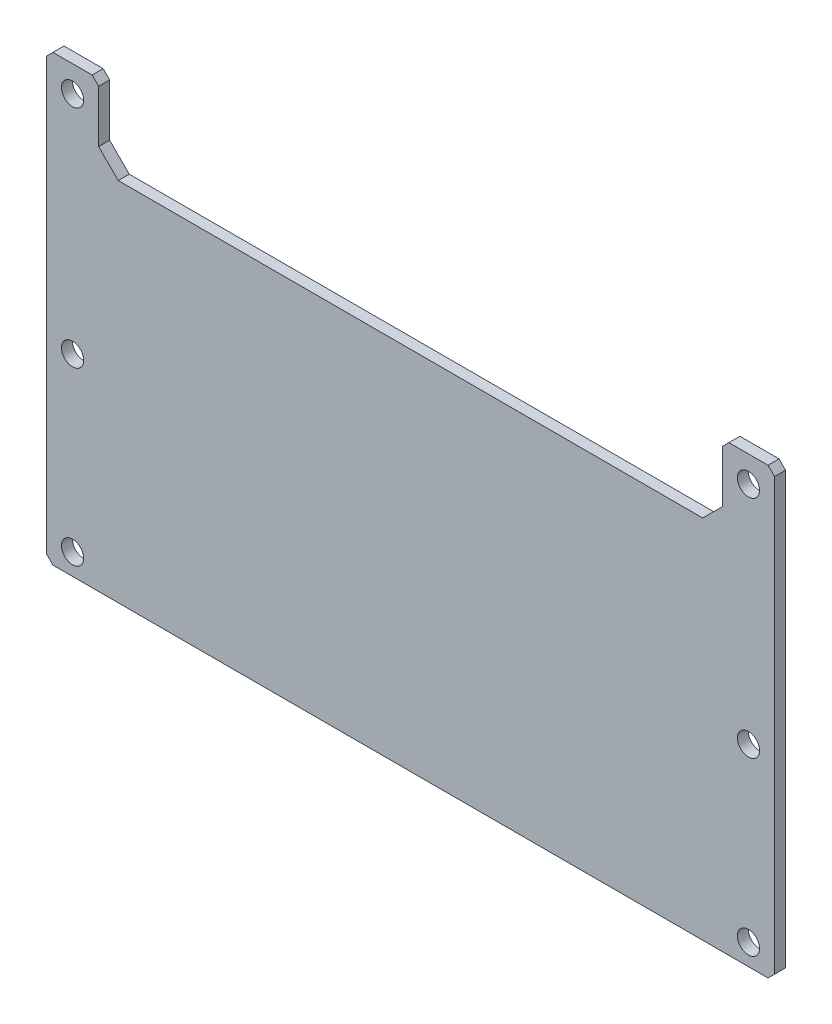
ISO-10303-21;
HEADER;
FILE_DESCRIPTION(('STEP AP214'),'2;1');
FILE_NAME('part.step','',(''),(''),'','','');
FILE_SCHEMA(('AUTOMOTIVE_DESIGN { 1 0 10303 214 1 1 1 1 }'));
ENDSEC;
DATA;
#1=APPLICATION_CONTEXT('core data for automotive mechanical design processes');
#2=APPLICATION_PROTOCOL_DEFINITION('international standard','automotive_design',2000,#1);
#3=PRODUCT_CONTEXT('',#1,'mechanical');
#4=PRODUCT('Part','Part','',(#3));
#5=PRODUCT_RELATED_PRODUCT_CATEGORY('part','',(#4));
#6=PRODUCT_DEFINITION_FORMATION('','',#4);
#7=PRODUCT_DEFINITION_CONTEXT('part definition',#1,'design');
#8=PRODUCT_DEFINITION('design','',#6,#7);
#9=PRODUCT_DEFINITION_SHAPE('','',#8);
#10=(LENGTH_UNIT() NAMED_UNIT(*) SI_UNIT(.MILLI.,.METRE.));
#11=(NAMED_UNIT(*) PLANE_ANGLE_UNIT() SI_UNIT($,.RADIAN.));
#12=(NAMED_UNIT(*) SI_UNIT($,.STERADIAN.) SOLID_ANGLE_UNIT());
#13=UNCERTAINTY_MEASURE_WITH_UNIT(LENGTH_MEASURE(1.E-05),#10,'distance_accuracy_value','');
#14=(GEOMETRIC_REPRESENTATION_CONTEXT(3) GLOBAL_UNCERTAINTY_ASSIGNED_CONTEXT((#13)) GLOBAL_UNIT_ASSIGNED_CONTEXT((#10,
#11,#12)) REPRESENTATION_CONTEXT('',''));
#15=CARTESIAN_POINT('',(0.,0.,0.));
#16=DIRECTION('',(0.,0.,1.));
#17=DIRECTION('',(1.,0.,0.));
#18=AXIS2_PLACEMENT_3D('',#15,#16,#17);
#19=CARTESIAN_POINT('',(0.,0.,1.68656));
#20=DIRECTION('',(0.,0.,1.));
#21=DIRECTION('',(1.,0.,0.));
#22=AXIS2_PLACEMENT_3D('',#19,#20,#21);
#23=PLANE('',#22);
#24=CARTESIAN_POINT('',(4.,29.5,1.68656));
#25=DIRECTION('',(0.,0.,1.));
#26=DIRECTION('',(1.,0.,0.));
#27=AXIS2_PLACEMENT_3D('',#24,#25,#26);
#28=CIRCLE('',#27,1.7);
#29=CARTESIAN_POINT('',(5.7,29.5,1.68656));
#30=VERTEX_POINT('',#29);
#31=EDGE_CURVE('E352',#30,#30,#28,.T.);
#32=ORIENTED_EDGE('',*,*,#31,.F.);
#33=EDGE_LOOP('',(#32));
#34=FACE_BOUND('',#33,.T.);
#35=CARTESIAN_POINT('',(107.5,3.25,1.68656));
#36=DIRECTION('',(0.,0.,1.));
#37=DIRECTION('',(1.,0.,0.));
#38=AXIS2_PLACEMENT_3D('',#35,#36,#37);
#39=CIRCLE('',#38,1.7);
#40=CARTESIAN_POINT('',(109.2,3.25,1.68656));
#41=VERTEX_POINT('',#40);
#42=EDGE_CURVE('E364',#41,#41,#39,.T.);
#43=ORIENTED_EDGE('',*,*,#42,.F.);
#44=EDGE_LOOP('',(#43));
#45=FACE_BOUND('',#44,.T.);
#46=CARTESIAN_POINT('',(107.5,29.5,1.68656));
#47=DIRECTION('',(0.,0.,1.));
#48=DIRECTION('',(1.,0.,0.));
#49=AXIS2_PLACEMENT_3D('',#46,#47,#48);
#50=CIRCLE('',#49,1.7);
#51=CARTESIAN_POINT('',(109.2,29.5,1.68656));
#52=VERTEX_POINT('',#51);
#53=EDGE_CURVE('E182',#52,#52,#50,.T.);
#54=ORIENTED_EDGE('',*,*,#53,.F.);
#55=EDGE_LOOP('',(#54));
#56=FACE_BOUND('',#55,.T.);
#57=DIRECTION('',(0.,-1.,0.));
#58=VECTOR('',#57,1.);
#59=CARTESIAN_POINT('',(0.,67.,1.68656));
#60=LINE('',#59,#58);
#61=CARTESIAN_POINT('',(0.,67.,1.68656));
#62=VERTEX_POINT('',#61);
#63=CARTESIAN_POINT('',(0.,1.,1.68656));
#64=VERTEX_POINT('',#63);
#65=EDGE_CURVE('E209',#62,#64,#60,.T.);
#66=ORIENTED_EDGE('',*,*,#65,.T.);
#67=DIRECTION('',(0.707106781186547,-0.707106781186547,0.));
#68=VECTOR('',#67,1.);
#69=CARTESIAN_POINT('',(0.,1.,1.68656));
#70=LINE('',#69,#68);
#71=CARTESIAN_POINT('',(1.,0.,1.68656));
#72=VERTEX_POINT('',#71);
#73=EDGE_CURVE('E117',#64,#72,#70,.T.);
#74=ORIENTED_EDGE('',*,*,#73,.T.);
#75=DIRECTION('',(1.,0.,0.));
#76=VECTOR('',#75,1.);
#77=CARTESIAN_POINT('',(1.,0.,1.68656));
#78=LINE('',#77,#76);
#79=CARTESIAN_POINT('',(110.5,0.,1.68656));
#80=VERTEX_POINT('',#79);
#81=EDGE_CURVE('E248',#72,#80,#78,.T.);
#82=ORIENTED_EDGE('',*,*,#81,.T.);
#83=DIRECTION('',(0.707106781186547,0.707106781186547,0.));
#84=VECTOR('',#83,1.);
#85=CARTESIAN_POINT('',(110.5,0.,1.68656));
#86=LINE('',#85,#84);
#87=CARTESIAN_POINT('',(111.5,1.,1.68656));
#88=VERTEX_POINT('',#87);
#89=EDGE_CURVE('E267',#80,#88,#86,.T.);
#90=ORIENTED_EDGE('',*,*,#89,.T.);
#91=DIRECTION('',(0.,1.,0.));
#92=VECTOR('',#91,1.);
#93=CARTESIAN_POINT('',(111.5,1.,1.68656));
#94=LINE('',#93,#92);
#95=CARTESIAN_POINT('',(111.5,67.,1.68656));
#96=VERTEX_POINT('',#95);
#97=EDGE_CURVE('E264',#88,#96,#94,.T.);
#98=ORIENTED_EDGE('',*,*,#97,.T.);
#99=DIRECTION('',(-0.707106781186547,0.707106781186547,0.));
#100=VECTOR('',#99,1.);
#101=CARTESIAN_POINT('',(111.5,67.,1.68656));
#102=LINE('',#101,#100);
#103=CARTESIAN_POINT('',(110.5,68.,1.68656));
#104=VERTEX_POINT('',#103);
#105=EDGE_CURVE('E266',#96,#104,#102,.T.);
#106=ORIENTED_EDGE('',*,*,#105,.T.);
#107=DIRECTION('',(-1.,0.,0.));
#108=VECTOR('',#107,1.);
#109=CARTESIAN_POINT('',(110.5,68.,1.68656));
#110=LINE('',#109,#108);
#111=CARTESIAN_POINT('',(104.5,68.,1.68656));
#112=VERTEX_POINT('',#111);
#113=EDGE_CURVE('E269',#104,#112,#110,.T.);
#114=ORIENTED_EDGE('',*,*,#113,.T.);
#115=DIRECTION('',(-0.707106781186543,-0.707106781186552,0.));
#116=VECTOR('',#115,1.);
#117=CARTESIAN_POINT('',(104.5,68.,1.68656));
#118=LINE('',#117,#116);
#119=CARTESIAN_POINT('',(103.5,67.,1.68656));
#120=VERTEX_POINT('',#119);
#121=EDGE_CURVE('E275',#112,#120,#118,.T.);
#122=ORIENTED_EDGE('',*,*,#121,.T.);
#123=DIRECTION('',(0.,-1.,0.));
#124=VECTOR('',#123,1.);
#125=CARTESIAN_POINT('',(103.5,67.,1.68656));
#126=LINE('',#125,#124);
#127=CARTESIAN_POINT('',(103.5,59.,1.68656));
#128=VERTEX_POINT('',#127);
#129=EDGE_CURVE('E277',#120,#128,#126,.T.);
#130=ORIENTED_EDGE('',*,*,#129,.T.);
#131=DIRECTION('',(-0.707106781186547,-0.707106781186547,0.));
#132=VECTOR('',#131,1.);
#133=CARTESIAN_POINT('',(103.5,59.,1.68656));
#134=LINE('',#133,#132);
#135=CARTESIAN_POINT('',(100.5,56.,1.68656));
#136=VERTEX_POINT('',#135);
#137=EDGE_CURVE('E279',#128,#136,#134,.T.);
#138=ORIENTED_EDGE('',*,*,#137,.T.);
#139=DIRECTION('',(-1.,0.,0.));
#140=VECTOR('',#139,1.);
#141=CARTESIAN_POINT('',(100.5,56.,1.68656));
#142=LINE('',#141,#140);
#143=CARTESIAN_POINT('',(11.,56.,1.68656));
#144=VERTEX_POINT('',#143);
#145=EDGE_CURVE('E281',#136,#144,#142,.T.);
#146=ORIENTED_EDGE('',*,*,#145,.T.);
#147=DIRECTION('',(-0.707106781186547,0.707106781186547,0.));
#148=VECTOR('',#147,1.);
#149=CARTESIAN_POINT('',(11.,56.,1.68656));
#150=LINE('',#149,#148);
#151=CARTESIAN_POINT('',(8.,59.,1.68656));
#152=VERTEX_POINT('',#151);
#153=EDGE_CURVE('E283',#144,#152,#150,.T.);
#154=ORIENTED_EDGE('',*,*,#153,.T.);
#155=DIRECTION('',(0.,1.,0.));
#156=VECTOR('',#155,1.);
#157=CARTESIAN_POINT('',(8.,59.,1.68656));
#158=LINE('',#157,#156);
#159=CARTESIAN_POINT('',(8.,67.,1.68656));
#160=VERTEX_POINT('',#159);
#161=EDGE_CURVE('E160',#152,#160,#158,.T.);
#162=ORIENTED_EDGE('',*,*,#161,.T.);
#163=DIRECTION('',(-0.707106781186547,0.707106781186547,0.));
#164=VECTOR('',#163,1.);
#165=CARTESIAN_POINT('',(8.,67.,1.68656));
#166=LINE('',#165,#164);
#167=CARTESIAN_POINT('',(7.,68.,1.68656));
#168=VERTEX_POINT('',#167);
#169=EDGE_CURVE('E154',#160,#168,#166,.T.);
#170=ORIENTED_EDGE('',*,*,#169,.T.);
#171=DIRECTION('',(-1.,0.,0.));
#172=VECTOR('',#171,1.);
#173=CARTESIAN_POINT('',(7.,68.,1.68656));
#174=LINE('',#173,#172);
#175=CARTESIAN_POINT('',(1.,68.,1.68656));
#176=VERTEX_POINT('',#175);
#177=EDGE_CURVE('E158',#168,#176,#174,.T.);
#178=ORIENTED_EDGE('',*,*,#177,.T.);
#179=DIRECTION('',(-0.707106781186547,-0.707106781186547,0.));
#180=VECTOR('',#179,1.);
#181=CARTESIAN_POINT('',(1.,68.,1.68656));
#182=LINE('',#181,#180);
#183=EDGE_CURVE('E50',#176,#62,#182,.T.);
#184=ORIENTED_EDGE('',*,*,#183,.T.);
#185=EDGE_LOOP('',(#66,#74,#82,#90,#98,#106,#114,#122,#130,#138,#146,#154,#162,#170,#178,#184));
#186=FACE_BOUND('',#185,.T.);
#187=CARTESIAN_POINT('',(107.5,64.,1.68656));
#188=DIRECTION('',(0.,0.,1.));
#189=DIRECTION('',(1.,0.,0.));
#190=AXIS2_PLACEMENT_3D('',#187,#188,#189);
#191=CIRCLE('',#190,1.7);
#192=CARTESIAN_POINT('',(109.2,64.,1.68656));
#193=VERTEX_POINT('',#192);
#194=EDGE_CURVE('E370',#193,#193,#191,.T.);
#195=ORIENTED_EDGE('',*,*,#194,.F.);
#196=EDGE_LOOP('',(#195));
#197=FACE_BOUND('',#196,.T.);
#198=CARTESIAN_POINT('',(4.,64.,1.68656));
#199=DIRECTION('',(0.,0.,1.));
#200=DIRECTION('',(1.,0.,0.));
#201=AXIS2_PLACEMENT_3D('',#198,#199,#200);
#202=CIRCLE('',#201,1.7);
#203=CARTESIAN_POINT('',(5.7,64.,1.68656));
#204=VERTEX_POINT('',#203);
#205=EDGE_CURVE('E358',#204,#204,#202,.T.);
#206=ORIENTED_EDGE('',*,*,#205,.F.);
#207=EDGE_LOOP('',(#206));
#208=FACE_BOUND('',#207,.T.);
#209=CARTESIAN_POINT('',(4.,3.25,1.68656));
#210=DIRECTION('',(0.,0.,1.));
#211=DIRECTION('',(1.,0.,0.));
#212=AXIS2_PLACEMENT_3D('',#209,#210,#211);
#213=CIRCLE('',#212,1.7);
#214=CARTESIAN_POINT('',(5.7,3.25,1.68656));
#215=VERTEX_POINT('',#214);
#216=EDGE_CURVE('E343',#215,#215,#213,.T.);
#217=ORIENTED_EDGE('',*,*,#216,.F.);
#218=EDGE_LOOP('',(#217));
#219=FACE_BOUND('',#218,.T.);
#220=ADVANCED_FACE('F33',(#34,#45,#56,#186,#197,#208,#219),#23,.T.);
#221=CARTESIAN_POINT('',(0.,0.,0.));
#222=DIRECTION('',(0.,0.,1.));
#223=DIRECTION('',(1.,0.,0.));
#224=AXIS2_PLACEMENT_3D('',#221,#222,#223);
#225=PLANE('',#224);
#226=CARTESIAN_POINT('',(4.,29.5,0.));
#227=DIRECTION('',(0.,0.,1.));
#228=DIRECTION('',(1.,0.,0.));
#229=AXIS2_PLACEMENT_3D('',#226,#227,#228);
#230=CIRCLE('',#229,1.7);
#231=CARTESIAN_POINT('',(5.7,29.5,0.));
#232=VERTEX_POINT('',#231);
#233=EDGE_CURVE('E349',#232,#232,#230,.T.);
#234=ORIENTED_EDGE('',*,*,#233,.T.);
#235=EDGE_LOOP('',(#234));
#236=FACE_BOUND('',#235,.T.);
#237=CARTESIAN_POINT('',(107.5,3.25,0.));
#238=DIRECTION('',(0.,0.,1.));
#239=DIRECTION('',(1.,0.,0.));
#240=AXIS2_PLACEMENT_3D('',#237,#238,#239);
#241=CIRCLE('',#240,1.7);
#242=CARTESIAN_POINT('',(109.2,3.25,0.));
#243=VERTEX_POINT('',#242);
#244=EDGE_CURVE('E361',#243,#243,#241,.T.);
#245=ORIENTED_EDGE('',*,*,#244,.T.);
#246=EDGE_LOOP('',(#245));
#247=FACE_BOUND('',#246,.T.);
#248=CARTESIAN_POINT('',(107.5,29.5,0.));
#249=DIRECTION('',(0.,0.,1.));
#250=DIRECTION('',(1.,0.,0.));
#251=AXIS2_PLACEMENT_3D('',#248,#249,#250);
#252=CIRCLE('',#251,1.7);
#253=CARTESIAN_POINT('',(109.2,29.5,0.));
#254=VERTEX_POINT('',#253);
#255=EDGE_CURVE('E373',#254,#254,#252,.T.);
#256=ORIENTED_EDGE('',*,*,#255,.T.);
#257=EDGE_LOOP('',(#256));
#258=FACE_BOUND('',#257,.T.);
#259=DIRECTION('',(0.,-1.,0.));
#260=VECTOR('',#259,1.);
#261=CARTESIAN_POINT('',(0.,67.,0.));
#262=LINE('',#261,#260);
#263=CARTESIAN_POINT('',(0.,67.,0.));
#264=VERTEX_POINT('',#263);
#265=CARTESIAN_POINT('',(0.,1.,0.));
#266=VERTEX_POINT('',#265);
#267=EDGE_CURVE('E178',#264,#266,#262,.T.);
#268=ORIENTED_EDGE('',*,*,#267,.F.);
#269=DIRECTION('',(-0.707106781186547,-0.707106781186547,0.));
#270=VECTOR('',#269,1.);
#271=CARTESIAN_POINT('',(1.,68.,0.));
#272=LINE('',#271,#270);
#273=CARTESIAN_POINT('',(1.,68.,0.));
#274=VERTEX_POINT('',#273);
#275=EDGE_CURVE('E109',#274,#264,#272,.T.);
#276=ORIENTED_EDGE('',*,*,#275,.F.);
#277=DIRECTION('',(-1.,0.,0.));
#278=VECTOR('',#277,1.);
#279=CARTESIAN_POINT('',(7.,68.,0.));
#280=LINE('',#279,#278);
#281=CARTESIAN_POINT('',(7.,68.,0.));
#282=VERTEX_POINT('',#281);
#283=EDGE_CURVE('E103',#282,#274,#280,.T.);
#284=ORIENTED_EDGE('',*,*,#283,.F.);
#285=DIRECTION('',(-0.707106781186547,0.707106781186547,0.));
#286=VECTOR('',#285,1.);
#287=CARTESIAN_POINT('',(8.,67.,0.));
#288=LINE('',#287,#286);
#289=CARTESIAN_POINT('',(8.,67.,0.));
#290=VERTEX_POINT('',#289);
#291=EDGE_CURVE('E168',#290,#282,#288,.T.);
#292=ORIENTED_EDGE('',*,*,#291,.F.);
#293=DIRECTION('',(0.,1.,0.));
#294=VECTOR('',#293,1.);
#295=CARTESIAN_POINT('',(8.,59.,0.));
#296=LINE('',#295,#294);
#297=CARTESIAN_POINT('',(8.,59.,0.));
#298=VERTEX_POINT('',#297);
#299=EDGE_CURVE('E204',#298,#290,#296,.T.);
#300=ORIENTED_EDGE('',*,*,#299,.F.);
#301=DIRECTION('',(-0.707106781186547,0.707106781186547,0.));
#302=VECTOR('',#301,1.);
#303=CARTESIAN_POINT('',(11.,56.,0.));
#304=LINE('',#303,#302);
#305=CARTESIAN_POINT('',(11.,56.,0.));
#306=VERTEX_POINT('',#305);
#307=EDGE_CURVE('E202',#306,#298,#304,.T.);
#308=ORIENTED_EDGE('',*,*,#307,.F.);
#309=DIRECTION('',(-1.,0.,0.));
#310=VECTOR('',#309,1.);
#311=CARTESIAN_POINT('',(100.5,56.,0.));
#312=LINE('',#311,#310);
#313=CARTESIAN_POINT('',(100.5,56.,0.));
#314=VERTEX_POINT('',#313);
#315=EDGE_CURVE('E200',#314,#306,#312,.T.);
#316=ORIENTED_EDGE('',*,*,#315,.F.);
#317=DIRECTION('',(-0.707106781186547,-0.707106781186547,0.));
#318=VECTOR('',#317,1.);
#319=CARTESIAN_POINT('',(103.5,59.,0.));
#320=LINE('',#319,#318);
#321=CARTESIAN_POINT('',(103.5,59.,0.));
#322=VERTEX_POINT('',#321);
#323=EDGE_CURVE('E198',#322,#314,#320,.T.);
#324=ORIENTED_EDGE('',*,*,#323,.F.);
#325=DIRECTION('',(0.,-1.,0.));
#326=VECTOR('',#325,1.);
#327=CARTESIAN_POINT('',(103.5,67.,0.));
#328=LINE('',#327,#326);
#329=CARTESIAN_POINT('',(103.5,67.,0.));
#330=VERTEX_POINT('',#329);
#331=EDGE_CURVE('E196',#330,#322,#328,.T.);
#332=ORIENTED_EDGE('',*,*,#331,.F.);
#333=DIRECTION('',(-0.707106781186543,-0.707106781186552,0.));
#334=VECTOR('',#333,1.);
#335=CARTESIAN_POINT('',(104.5,68.,0.));
#336=LINE('',#335,#334);
#337=CARTESIAN_POINT('',(104.5,68.,0.));
#338=VERTEX_POINT('',#337);
#339=EDGE_CURVE('E194',#338,#330,#336,.T.);
#340=ORIENTED_EDGE('',*,*,#339,.F.);
#341=DIRECTION('',(-1.,0.,0.));
#342=VECTOR('',#341,1.);
#343=CARTESIAN_POINT('',(110.5,68.,0.));
#344=LINE('',#343,#342);
#345=CARTESIAN_POINT('',(110.5,68.,0.));
#346=VERTEX_POINT('',#345);
#347=EDGE_CURVE('E192',#346,#338,#344,.T.);
#348=ORIENTED_EDGE('',*,*,#347,.F.);
#349=DIRECTION('',(-0.707106781186547,0.707106781186547,0.));
#350=VECTOR('',#349,1.);
#351=CARTESIAN_POINT('',(111.5,67.,0.));
#352=LINE('',#351,#350);
#353=CARTESIAN_POINT('',(111.5,67.,0.));
#354=VERTEX_POINT('',#353);
#355=EDGE_CURVE('E190',#354,#346,#352,.T.);
#356=ORIENTED_EDGE('',*,*,#355,.F.);
#357=DIRECTION('',(0.,1.,0.));
#358=VECTOR('',#357,1.);
#359=CARTESIAN_POINT('',(111.5,1.,0.));
#360=LINE('',#359,#358);
#361=CARTESIAN_POINT('',(111.5,1.,0.));
#362=VERTEX_POINT('',#361);
#363=EDGE_CURVE('E188',#362,#354,#360,.T.);
#364=ORIENTED_EDGE('',*,*,#363,.F.);
#365=DIRECTION('',(0.707106781186547,0.707106781186547,0.));
#366=VECTOR('',#365,1.);
#367=CARTESIAN_POINT('',(110.5,0.,0.));
#368=LINE('',#367,#366);
#369=CARTESIAN_POINT('',(110.5,0.,0.));
#370=VERTEX_POINT('',#369);
#371=EDGE_CURVE('E186',#370,#362,#368,.T.);
#372=ORIENTED_EDGE('',*,*,#371,.F.);
#373=DIRECTION('',(1.,0.,0.));
#374=VECTOR('',#373,1.);
#375=CARTESIAN_POINT('',(1.,0.,0.));
#376=LINE('',#375,#374);
#377=CARTESIAN_POINT('',(1.,0.,0.));
#378=VERTEX_POINT('',#377);
#379=EDGE_CURVE('E184',#378,#370,#376,.T.);
#380=ORIENTED_EDGE('',*,*,#379,.F.);
#381=DIRECTION('',(0.707106781186547,-0.707106781186547,0.));
#382=VECTOR('',#381,1.);
#383=CARTESIAN_POINT('',(0.,1.,0.));
#384=LINE('',#383,#382);
#385=EDGE_CURVE('E181',#266,#378,#384,.T.);
#386=ORIENTED_EDGE('',*,*,#385,.F.);
#387=EDGE_LOOP('',(#268,#276,#284,#292,#300,#308,#316,#324,#332,#340,#348,#356,#364,#372,#380,#386));
#388=FACE_BOUND('',#387,.T.);
#389=CARTESIAN_POINT('',(107.5,64.,0.));
#390=DIRECTION('',(0.,0.,1.));
#391=DIRECTION('',(1.,0.,0.));
#392=AXIS2_PLACEMENT_3D('',#389,#390,#391);
#393=CIRCLE('',#392,1.7);
#394=CARTESIAN_POINT('',(109.2,64.,0.));
#395=VERTEX_POINT('',#394);
#396=EDGE_CURVE('E367',#395,#395,#393,.T.);
#397=ORIENTED_EDGE('',*,*,#396,.T.);
#398=EDGE_LOOP('',(#397));
#399=FACE_BOUND('',#398,.T.);
#400=CARTESIAN_POINT('',(4.,64.,0.));
#401=DIRECTION('',(0.,0.,1.));
#402=DIRECTION('',(1.,0.,0.));
#403=AXIS2_PLACEMENT_3D('',#400,#401,#402);
#404=CIRCLE('',#403,1.7);
#405=CARTESIAN_POINT('',(5.7,64.,0.));
#406=VERTEX_POINT('',#405);
#407=EDGE_CURVE('E355',#406,#406,#404,.T.);
#408=ORIENTED_EDGE('',*,*,#407,.T.);
#409=EDGE_LOOP('',(#408));
#410=FACE_BOUND('',#409,.T.);
#411=CARTESIAN_POINT('',(4.,3.25,0.));
#412=DIRECTION('',(0.,0.,1.));
#413=DIRECTION('',(1.,0.,0.));
#414=AXIS2_PLACEMENT_3D('',#411,#412,#413);
#415=CIRCLE('',#414,1.7);
#416=CARTESIAN_POINT('',(5.7,3.25,0.));
#417=VERTEX_POINT('',#416);
#418=EDGE_CURVE('E346',#417,#417,#415,.T.);
#419=ORIENTED_EDGE('',*,*,#418,.T.);
#420=EDGE_LOOP('',(#419));
#421=FACE_BOUND('',#420,.T.);
#422=ADVANCED_FACE('F252',(#236,#247,#258,#388,#399,#410,#421),#225,.F.);
#423=CARTESIAN_POINT('',(0.,67.,1.68656));
#424=DIRECTION('',(1.,0.,0.));
#425=DIRECTION('',(0.,0.,-1.));
#426=AXIS2_PLACEMENT_3D('',#423,#424,#425);
#427=PLANE('',#426);
#428=ORIENTED_EDGE('',*,*,#267,.T.);
#429=DIRECTION('',(0.,0.,-1.));
#430=VECTOR('',#429,1.);
#431=CARTESIAN_POINT('',(0.,1.,1.68656));
#432=LINE('',#431,#430);
#433=EDGE_CURVE('E11',#64,#266,#432,.T.);
#434=ORIENTED_EDGE('',*,*,#433,.F.);
#435=ORIENTED_EDGE('',*,*,#65,.F.);
#436=DIRECTION('',(0.,0.,-1.));
#437=VECTOR('',#436,1.);
#438=CARTESIAN_POINT('',(0.,67.,1.68656));
#439=LINE('',#438,#437);
#440=EDGE_CURVE('E174',#62,#264,#439,.T.);
#441=ORIENTED_EDGE('',*,*,#440,.T.);
#442=EDGE_LOOP('',(#428,#434,#435,#441));
#443=FACE_BOUND('',#442,.T.);
#444=ADVANCED_FACE('F35',(#443),#427,.F.);
#445=CARTESIAN_POINT('',(0.,1.,1.68656));
#446=DIRECTION('',(0.707106781186547,0.707106781186547,0.));
#447=DIRECTION('',(-0.707106781186548,0.707106781186548,0.));
#448=AXIS2_PLACEMENT_3D('',#445,#446,#447);
#449=PLANE('',#448);
#450=ORIENTED_EDGE('',*,*,#385,.T.);
#451=DIRECTION('',(0.,0.,-1.));
#452=VECTOR('',#451,1.);
#453=CARTESIAN_POINT('',(1.,0.,1.68656));
#454=LINE('',#453,#452);
#455=EDGE_CURVE('E42',#72,#378,#454,.T.);
#456=ORIENTED_EDGE('',*,*,#455,.F.);
#457=ORIENTED_EDGE('',*,*,#73,.F.);
#458=ORIENTED_EDGE('',*,*,#433,.T.);
#459=EDGE_LOOP('',(#450,#456,#457,#458));
#460=FACE_BOUND('',#459,.T.);
#461=ADVANCED_FACE('F540',(#460),#449,.F.);
#462=CARTESIAN_POINT('',(1.,0.,1.68656));
#463=DIRECTION('',(0.,1.,0.));
#464=DIRECTION('',(0.,0.,1.));
#465=AXIS2_PLACEMENT_3D('',#462,#463,#464);
#466=PLANE('',#465);
#467=ORIENTED_EDGE('',*,*,#379,.T.);
#468=DIRECTION('',(0.,0.,-1.));
#469=VECTOR('',#468,1.);
#470=CARTESIAN_POINT('',(110.5,0.,1.68656));
#471=LINE('',#470,#469);
#472=EDGE_CURVE('E240',#80,#370,#471,.T.);
#473=ORIENTED_EDGE('',*,*,#472,.F.);
#474=ORIENTED_EDGE('',*,*,#81,.F.);
#475=ORIENTED_EDGE('',*,*,#455,.T.);
#476=EDGE_LOOP('',(#467,#473,#474,#475));
#477=FACE_BOUND('',#476,.T.);
#478=ADVANCED_FACE('F246',(#477),#466,.F.);
#479=CARTESIAN_POINT('',(110.5,0.,1.68656));
#480=DIRECTION('',(-0.707106781186547,0.707106781186547,0.));
#481=DIRECTION('',(-0.707106781186548,-0.707106781186548,0.));
#482=AXIS2_PLACEMENT_3D('',#479,#480,#481);
#483=PLANE('',#482);
#484=ORIENTED_EDGE('',*,*,#371,.T.);
#485=DIRECTION('',(0.,0.,-1.));
#486=VECTOR('',#485,1.);
#487=CARTESIAN_POINT('',(111.5,1.,1.68656));
#488=LINE('',#487,#486);
#489=EDGE_CURVE('E237',#88,#362,#488,.T.);
#490=ORIENTED_EDGE('',*,*,#489,.F.);
#491=ORIENTED_EDGE('',*,*,#89,.F.);
#492=ORIENTED_EDGE('',*,*,#472,.T.);
#493=EDGE_LOOP('',(#484,#490,#491,#492));
#494=FACE_BOUND('',#493,.T.);
#495=ADVANCED_FACE('F258',(#494),#483,.F.);
#496=CARTESIAN_POINT('',(111.5,1.,1.68656));
#497=DIRECTION('',(-1.,0.,0.));
#498=DIRECTION('',(0.,0.,1.));
#499=AXIS2_PLACEMENT_3D('',#496,#497,#498);
#500=PLANE('',#499);
#501=ORIENTED_EDGE('',*,*,#363,.T.);
#502=DIRECTION('',(0.,0.,-1.));
#503=VECTOR('',#502,1.);
#504=CARTESIAN_POINT('',(111.5,67.,1.68656));
#505=LINE('',#504,#503);
#506=EDGE_CURVE('E234',#96,#354,#505,.T.);
#507=ORIENTED_EDGE('',*,*,#506,.F.);
#508=ORIENTED_EDGE('',*,*,#97,.F.);
#509=ORIENTED_EDGE('',*,*,#489,.T.);
#510=EDGE_LOOP('',(#501,#507,#508,#509));
#511=FACE_BOUND('',#510,.T.);
#512=ADVANCED_FACE('F262',(#511),#500,.F.);
#513=CARTESIAN_POINT('',(111.5,67.,1.68656));
#514=DIRECTION('',(-0.707106781186547,-0.707106781186547,0.));
#515=DIRECTION('',(0.707106781186548,-0.707106781186548,0.));
#516=AXIS2_PLACEMENT_3D('',#513,#514,#515);
#517=PLANE('',#516);
#518=ORIENTED_EDGE('',*,*,#355,.T.);
#519=DIRECTION('',(0.,0.,-1.));
#520=VECTOR('',#519,1.);
#521=CARTESIAN_POINT('',(110.5,68.,1.68656));
#522=LINE('',#521,#520);
#523=EDGE_CURVE('E231',#104,#346,#522,.T.);
#524=ORIENTED_EDGE('',*,*,#523,.F.);
#525=ORIENTED_EDGE('',*,*,#105,.F.);
#526=ORIENTED_EDGE('',*,*,#506,.T.);
#527=EDGE_LOOP('',(#518,#524,#525,#526));
#528=FACE_BOUND('',#527,.T.);
#529=ADVANCED_FACE('F505',(#528),#517,.F.);
#530=CARTESIAN_POINT('',(110.5,68.,1.68656));
#531=DIRECTION('',(0.,-1.,0.));
#532=DIRECTION('',(0.,0.,-1.));
#533=AXIS2_PLACEMENT_3D('',#530,#531,#532);
#534=PLANE('',#533);
#535=ORIENTED_EDGE('',*,*,#347,.T.);
#536=DIRECTION('',(0.,0.,-1.));
#537=VECTOR('',#536,1.);
#538=CARTESIAN_POINT('',(104.5,68.,1.68656));
#539=LINE('',#538,#537);
#540=EDGE_CURVE('E228',#112,#338,#539,.T.);
#541=ORIENTED_EDGE('',*,*,#540,.F.);
#542=ORIENTED_EDGE('',*,*,#113,.F.);
#543=ORIENTED_EDGE('',*,*,#523,.T.);
#544=EDGE_LOOP('',(#535,#541,#542,#543));
#545=FACE_BOUND('',#544,.T.);
#546=ADVANCED_FACE('F495',(#545),#534,.F.);
#547=CARTESIAN_POINT('',(104.5,68.,1.68656));
#548=DIRECTION('',(0.707106781186552,-0.707106781186543,0.));
#549=DIRECTION('',(0.707106781186543,0.707106781186552,0.));
#550=AXIS2_PLACEMENT_3D('',#547,#548,#549);
#551=PLANE('',#550);
#552=ORIENTED_EDGE('',*,*,#339,.T.);
#553=DIRECTION('',(0.,0.,-1.));
#554=VECTOR('',#553,1.);
#555=CARTESIAN_POINT('',(103.5,67.,1.68656));
#556=LINE('',#555,#554);
#557=EDGE_CURVE('E225',#120,#330,#556,.T.);
#558=ORIENTED_EDGE('',*,*,#557,.F.);
#559=ORIENTED_EDGE('',*,*,#121,.F.);
#560=ORIENTED_EDGE('',*,*,#540,.T.);
#561=EDGE_LOOP('',(#552,#558,#559,#560));
#562=FACE_BOUND('',#561,.T.);
#563=ADVANCED_FACE('F485',(#562),#551,.F.);
#564=CARTESIAN_POINT('',(103.5,67.,1.68656));
#565=DIRECTION('',(1.,0.,0.));
#566=DIRECTION('',(0.,0.,-1.));
#567=AXIS2_PLACEMENT_3D('',#564,#565,#566);
#568=PLANE('',#567);
#569=ORIENTED_EDGE('',*,*,#331,.T.);
#570=DIRECTION('',(0.,0.,-1.));
#571=VECTOR('',#570,1.);
#572=CARTESIAN_POINT('',(103.5,59.,1.68656));
#573=LINE('',#572,#571);
#574=EDGE_CURVE('E222',#128,#322,#573,.T.);
#575=ORIENTED_EDGE('',*,*,#574,.F.);
#576=ORIENTED_EDGE('',*,*,#129,.F.);
#577=ORIENTED_EDGE('',*,*,#557,.T.);
#578=EDGE_LOOP('',(#569,#575,#576,#577));
#579=FACE_BOUND('',#578,.T.);
#580=ADVANCED_FACE('F475',(#579),#568,.F.);
#581=CARTESIAN_POINT('',(103.5,59.,1.68656));
#582=DIRECTION('',(0.707106781186547,-0.707106781186547,0.));
#583=DIRECTION('',(0.707106781186548,0.707106781186548,0.));
#584=AXIS2_PLACEMENT_3D('',#581,#582,#583);
#585=PLANE('',#584);
#586=ORIENTED_EDGE('',*,*,#323,.T.);
#587=DIRECTION('',(0.,0.,-1.));
#588=VECTOR('',#587,1.);
#589=CARTESIAN_POINT('',(100.5,56.,1.68656));
#590=LINE('',#589,#588);
#591=EDGE_CURVE('E219',#136,#314,#590,.T.);
#592=ORIENTED_EDGE('',*,*,#591,.F.);
#593=ORIENTED_EDGE('',*,*,#137,.F.);
#594=ORIENTED_EDGE('',*,*,#574,.T.);
#595=EDGE_LOOP('',(#586,#592,#593,#594));
#596=FACE_BOUND('',#595,.T.);
#597=ADVANCED_FACE('F465',(#596),#585,.F.);
#598=CARTESIAN_POINT('',(100.5,56.,1.68656));
#599=DIRECTION('',(0.,-1.,0.));
#600=DIRECTION('',(0.,0.,-1.));
#601=AXIS2_PLACEMENT_3D('',#598,#599,#600);
#602=PLANE('',#601);
#603=ORIENTED_EDGE('',*,*,#315,.T.);
#604=DIRECTION('',(0.,0.,-1.));
#605=VECTOR('',#604,1.);
#606=CARTESIAN_POINT('',(11.,56.,1.68656));
#607=LINE('',#606,#605);
#608=EDGE_CURVE('E216',#144,#306,#607,.T.);
#609=ORIENTED_EDGE('',*,*,#608,.F.);
#610=ORIENTED_EDGE('',*,*,#145,.F.);
#611=ORIENTED_EDGE('',*,*,#591,.T.);
#612=EDGE_LOOP('',(#603,#609,#610,#611));
#613=FACE_BOUND('',#612,.T.);
#614=ADVANCED_FACE('F456',(#613),#602,.F.);
#615=CARTESIAN_POINT('',(11.,56.,1.68656));
#616=DIRECTION('',(-0.707106781186547,-0.707106781186547,0.));
#617=DIRECTION('',(0.707106781186548,-0.707106781186548,0.));
#618=AXIS2_PLACEMENT_3D('',#615,#616,#617);
#619=PLANE('',#618);
#620=ORIENTED_EDGE('',*,*,#307,.T.);
#621=DIRECTION('',(0.,0.,-1.));
#622=VECTOR('',#621,1.);
#623=CARTESIAN_POINT('',(8.,59.,1.68656));
#624=LINE('',#623,#622);
#625=EDGE_CURVE('E213',#152,#298,#624,.T.);
#626=ORIENTED_EDGE('',*,*,#625,.F.);
#627=ORIENTED_EDGE('',*,*,#153,.F.);
#628=ORIENTED_EDGE('',*,*,#608,.T.);
#629=EDGE_LOOP('',(#620,#626,#627,#628));
#630=FACE_BOUND('',#629,.T.);
#631=ADVANCED_FACE('F289',(#630),#619,.F.);
#632=CARTESIAN_POINT('',(8.,59.,1.68656));
#633=DIRECTION('',(-1.,0.,0.));
#634=DIRECTION('',(0.,0.,1.));
#635=AXIS2_PLACEMENT_3D('',#632,#633,#634);
#636=PLANE('',#635);
#637=ORIENTED_EDGE('',*,*,#299,.T.);
#638=DIRECTION('',(0.,0.,-1.));
#639=VECTOR('',#638,1.);
#640=CARTESIAN_POINT('',(8.,67.,1.68656));
#641=LINE('',#640,#639);
#642=EDGE_CURVE('E169',#160,#290,#641,.T.);
#643=ORIENTED_EDGE('',*,*,#642,.F.);
#644=ORIENTED_EDGE('',*,*,#161,.F.);
#645=ORIENTED_EDGE('',*,*,#625,.T.);
#646=EDGE_LOOP('',(#637,#643,#644,#645));
#647=FACE_BOUND('',#646,.T.);
#648=ADVANCED_FACE('F293',(#647),#636,.F.);
#649=CARTESIAN_POINT('',(8.,67.,1.68656));
#650=DIRECTION('',(-0.707106781186547,-0.707106781186547,0.));
#651=DIRECTION('',(0.707106781186548,-0.707106781186548,0.));
#652=AXIS2_PLACEMENT_3D('',#649,#650,#651);
#653=PLANE('',#652);
#654=ORIENTED_EDGE('',*,*,#291,.T.);
#655=DIRECTION('',(0.,0.,-1.));
#656=VECTOR('',#655,1.);
#657=CARTESIAN_POINT('',(7.,68.,1.68656));
#658=LINE('',#657,#656);
#659=EDGE_CURVE('E165',#168,#282,#658,.T.);
#660=ORIENTED_EDGE('',*,*,#659,.F.);
#661=ORIENTED_EDGE('',*,*,#169,.F.);
#662=ORIENTED_EDGE('',*,*,#642,.T.);
#663=EDGE_LOOP('',(#654,#660,#661,#662));
#664=FACE_BOUND('',#663,.T.);
#665=ADVANCED_FACE('F166',(#664),#653,.F.);
#666=CARTESIAN_POINT('',(7.,68.,1.68656));
#667=DIRECTION('',(0.,-1.,0.));
#668=DIRECTION('',(0.,0.,-1.));
#669=AXIS2_PLACEMENT_3D('',#666,#667,#668);
#670=PLANE('',#669);
#671=ORIENTED_EDGE('',*,*,#283,.T.);
#672=DIRECTION('',(0.,0.,-1.));
#673=VECTOR('',#672,1.);
#674=CARTESIAN_POINT('',(1.,68.,1.68656));
#675=LINE('',#674,#673);
#676=EDGE_CURVE('E170',#176,#274,#675,.T.);
#677=ORIENTED_EDGE('',*,*,#676,.F.);
#678=ORIENTED_EDGE('',*,*,#177,.F.);
#679=ORIENTED_EDGE('',*,*,#659,.T.);
#680=EDGE_LOOP('',(#671,#677,#678,#679));
#681=FACE_BOUND('',#680,.T.);
#682=ADVANCED_FACE('F172',(#681),#670,.F.);
#683=CARTESIAN_POINT('',(1.,68.,1.68656));
#684=DIRECTION('',(0.707106781186547,-0.707106781186547,0.));
#685=DIRECTION('',(0.707106781186548,0.707106781186548,0.));
#686=AXIS2_PLACEMENT_3D('',#683,#684,#685);
#687=PLANE('',#686);
#688=ORIENTED_EDGE('',*,*,#275,.T.);
#689=ORIENTED_EDGE('',*,*,#440,.F.);
#690=ORIENTED_EDGE('',*,*,#183,.F.);
#691=ORIENTED_EDGE('',*,*,#676,.T.);
#692=EDGE_LOOP('',(#688,#689,#690,#691));
#693=FACE_BOUND('',#692,.T.);
#694=ADVANCED_FACE('F297',(#693),#687,.F.);
#695=CARTESIAN_POINT('',(107.5,29.5,1.68656));
#696=DIRECTION('',(0.,0.,-1.));
#697=DIRECTION('',(-1.,0.,0.));
#698=AXIS2_PLACEMENT_3D('',#695,#696,#697);
#699=CYLINDRICAL_SURFACE('',#698,1.7);
#700=ORIENTED_EDGE('',*,*,#53,.T.);
#701=EDGE_LOOP('',(#700));
#702=FACE_BOUND('',#701,.T.);
#703=ORIENTED_EDGE('',*,*,#255,.F.);
#704=EDGE_LOOP('',(#703));
#705=FACE_BOUND('',#704,.T.);
#706=ADVANCED_FACE('F299',(#702,#705),#699,.F.);
#707=CARTESIAN_POINT('',(107.5,64.,1.68656));
#708=DIRECTION('',(0.,0.,-1.));
#709=DIRECTION('',(-1.,0.,0.));
#710=AXIS2_PLACEMENT_3D('',#707,#708,#709);
#711=CYLINDRICAL_SURFACE('',#710,1.7);
#712=ORIENTED_EDGE('',*,*,#194,.T.);
#713=EDGE_LOOP('',(#712));
#714=FACE_BOUND('',#713,.T.);
#715=ORIENTED_EDGE('',*,*,#396,.F.);
#716=EDGE_LOOP('',(#715));
#717=FACE_BOUND('',#716,.T.);
#718=ADVANCED_FACE('F305',(#714,#717),#711,.F.);
#719=CARTESIAN_POINT('',(107.5,3.25,1.68656));
#720=DIRECTION('',(0.,0.,-1.));
#721=DIRECTION('',(-1.,0.,0.));
#722=AXIS2_PLACEMENT_3D('',#719,#720,#721);
#723=CYLINDRICAL_SURFACE('',#722,1.7);
#724=ORIENTED_EDGE('',*,*,#42,.T.);
#725=EDGE_LOOP('',(#724));
#726=FACE_BOUND('',#725,.T.);
#727=ORIENTED_EDGE('',*,*,#244,.F.);
#728=EDGE_LOOP('',(#727));
#729=FACE_BOUND('',#728,.T.);
#730=ADVANCED_FACE('F322',(#726,#729),#723,.F.);
#731=CARTESIAN_POINT('',(4.,64.,1.68656));
#732=DIRECTION('',(0.,0.,-1.));
#733=DIRECTION('',(-1.,0.,0.));
#734=AXIS2_PLACEMENT_3D('',#731,#732,#733);
#735=CYLINDRICAL_SURFACE('',#734,1.7);
#736=ORIENTED_EDGE('',*,*,#205,.T.);
#737=EDGE_LOOP('',(#736));
#738=FACE_BOUND('',#737,.T.);
#739=ORIENTED_EDGE('',*,*,#407,.F.);
#740=EDGE_LOOP('',(#739));
#741=FACE_BOUND('',#740,.T.);
#742=ADVANCED_FACE('F326',(#738,#741),#735,.F.);
#743=CARTESIAN_POINT('',(4.,29.5,1.68656));
#744=DIRECTION('',(0.,0.,-1.));
#745=DIRECTION('',(-1.,0.,0.));
#746=AXIS2_PLACEMENT_3D('',#743,#744,#745);
#747=CYLINDRICAL_SURFACE('',#746,1.7);
#748=ORIENTED_EDGE('',*,*,#31,.T.);
#749=EDGE_LOOP('',(#748));
#750=FACE_BOUND('',#749,.T.);
#751=ORIENTED_EDGE('',*,*,#233,.F.);
#752=EDGE_LOOP('',(#751));
#753=FACE_BOUND('',#752,.T.);
#754=ADVANCED_FACE('F330',(#750,#753),#747,.F.);
#755=CARTESIAN_POINT('',(4.,3.25,1.68656));
#756=DIRECTION('',(0.,0.,-1.));
#757=DIRECTION('',(-1.,0.,0.));
#758=AXIS2_PLACEMENT_3D('',#755,#756,#757);
#759=CYLINDRICAL_SURFACE('',#758,1.7);
#760=ORIENTED_EDGE('',*,*,#216,.T.);
#761=EDGE_LOOP('',(#760));
#762=FACE_BOUND('',#761,.T.);
#763=ORIENTED_EDGE('',*,*,#418,.F.);
#764=EDGE_LOOP('',(#763));
#765=FACE_BOUND('',#764,.T.);
#766=ADVANCED_FACE('F334',(#762,#765),#759,.F.);
#767=CLOSED_SHELL('',(#220,#422,#444,#461,#478,#495,#512,#529,#546,#563,#580,#597,#614,#631,
#648,#665,#682,#694,#706,#718,#730,#742,#754,#766));
#768=MANIFOLD_SOLID_BREP('B2',#767);
#769=ADVANCED_BREP_SHAPE_REPRESENTATION('',(#18,#768),#14);
#770=SHAPE_DEFINITION_REPRESENTATION(#9,#769);
ENDSEC;
END-ISO-10303-21;
